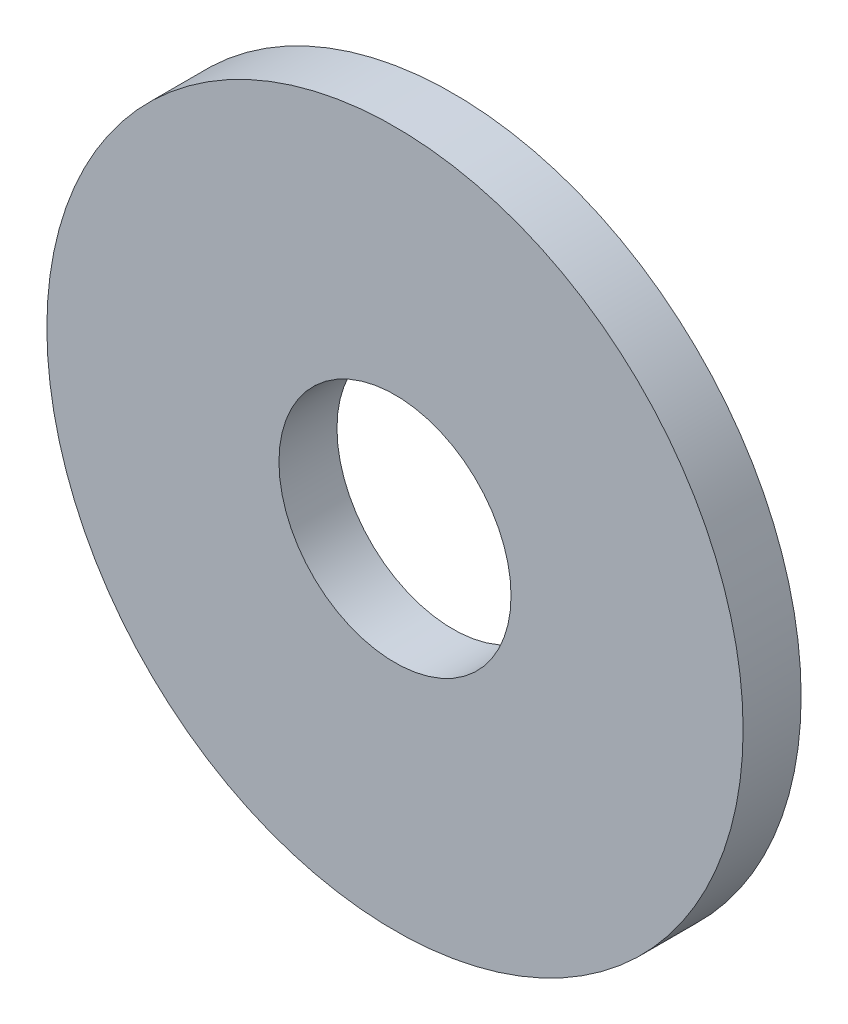
ISO-10303-21;
HEADER;
FILE_DESCRIPTION(('STEP AP214'),'2;1');
FILE_NAME('part.step','',(''),(''),'','','');
FILE_SCHEMA(('AUTOMOTIVE_DESIGN { 1 0 10303 214 1 1 1 1 }'));
ENDSEC;
DATA;
#1=APPLICATION_CONTEXT('core data for automotive mechanical design processes');
#2=APPLICATION_PROTOCOL_DEFINITION('international standard','automotive_design',2000,#1);
#3=PRODUCT_CONTEXT('',#1,'mechanical');
#4=PRODUCT('Part','Part','',(#3));
#5=PRODUCT_RELATED_PRODUCT_CATEGORY('part','',(#4));
#6=PRODUCT_DEFINITION_FORMATION('','',#4);
#7=PRODUCT_DEFINITION_CONTEXT('part definition',#1,'design');
#8=PRODUCT_DEFINITION('design','',#6,#7);
#9=PRODUCT_DEFINITION_SHAPE('','',#8);
#10=(LENGTH_UNIT() NAMED_UNIT(*) SI_UNIT(.MILLI.,.METRE.));
#11=(NAMED_UNIT(*) PLANE_ANGLE_UNIT() SI_UNIT($,.RADIAN.));
#12=(NAMED_UNIT(*) SI_UNIT($,.STERADIAN.) SOLID_ANGLE_UNIT());
#13=UNCERTAINTY_MEASURE_WITH_UNIT(LENGTH_MEASURE(1.E-05),#10,'distance_accuracy_value','');
#14=(GEOMETRIC_REPRESENTATION_CONTEXT(3) GLOBAL_UNCERTAINTY_ASSIGNED_CONTEXT((#13)) GLOBAL_UNIT_ASSIGNED_CONTEXT((#10,
#11,#12)) REPRESENTATION_CONTEXT('',''));
#15=CARTESIAN_POINT('',(0.,0.,0.));
#16=DIRECTION('',(0.,0.,1.));
#17=DIRECTION('',(1.,0.,0.));
#18=AXIS2_PLACEMENT_3D('',#15,#16,#17);
#19=CARTESIAN_POINT('',(0.,0.,-1.));
#20=DIRECTION('',(0.,0.,-1.));
#21=DIRECTION('',(1.,0.,0.));
#22=AXIS2_PLACEMENT_3D('',#19,#20,#21);
#23=PLANE('',#22);
#24=CARTESIAN_POINT('',(0.,0.,-1.));
#25=DIRECTION('',(0.,0.,1.));
#26=DIRECTION('',(1.,0.,0.));
#27=AXIS2_PLACEMENT_3D('',#24,#25,#26);
#28=CIRCLE('',#27,6.);
#29=CARTESIAN_POINT('',(6.,0.,-1.));
#30=VERTEX_POINT('',#29);
#31=EDGE_CURVE('E10',#30,#30,#28,.T.);
#32=ORIENTED_EDGE('',*,*,#31,.F.);
#33=EDGE_LOOP('',(#32));
#34=FACE_BOUND('',#33,.T.);
#35=CARTESIAN_POINT('',(0.,0.,-1.));
#36=DIRECTION('',(0.,0.,1.));
#37=DIRECTION('',(1.,0.,0.));
#38=AXIS2_PLACEMENT_3D('',#35,#36,#37);
#39=CIRCLE('',#38,2.);
#40=CARTESIAN_POINT('',(2.,0.,-1.));
#41=VERTEX_POINT('',#40);
#42=EDGE_CURVE('E46',#41,#41,#39,.T.);
#43=ORIENTED_EDGE('',*,*,#42,.T.);
#44=EDGE_LOOP('',(#43));
#45=FACE_BOUND('',#44,.T.);
#46=ADVANCED_FACE('F35',(#34,#45),#23,.T.);
#47=CARTESIAN_POINT('',(0.,0.,0.));
#48=DIRECTION('',(0.,0.,-1.));
#49=DIRECTION('',(1.,0.,0.));
#50=AXIS2_PLACEMENT_3D('',#47,#48,#49);
#51=PLANE('',#50);
#52=CARTESIAN_POINT('',(0.,0.,0.));
#53=DIRECTION('',(0.,0.,1.));
#54=DIRECTION('',(1.,0.,0.));
#55=AXIS2_PLACEMENT_3D('',#52,#53,#54);
#56=CIRCLE('',#55,6.);
#57=CARTESIAN_POINT('',(6.,0.,0.));
#58=VERTEX_POINT('',#57);
#59=EDGE_CURVE('E39',#58,#58,#56,.T.);
#60=ORIENTED_EDGE('',*,*,#59,.T.);
#61=EDGE_LOOP('',(#60));
#62=FACE_BOUND('',#61,.T.);
#63=CARTESIAN_POINT('',(0.,0.,0.));
#64=DIRECTION('',(0.,0.,1.));
#65=DIRECTION('',(1.,0.,0.));
#66=AXIS2_PLACEMENT_3D('',#63,#64,#65);
#67=CIRCLE('',#66,2.);
#68=CARTESIAN_POINT('',(2.,0.,0.));
#69=VERTEX_POINT('',#68);
#70=EDGE_CURVE('E48',#69,#69,#67,.T.);
#71=ORIENTED_EDGE('',*,*,#70,.F.);
#72=EDGE_LOOP('',(#71));
#73=FACE_BOUND('',#72,.T.);
#74=ADVANCED_FACE('F61',(#62,#73),#51,.F.);
#75=CARTESIAN_POINT('',(0.,0.,-1.));
#76=DIRECTION('',(0.,0.,1.));
#77=DIRECTION('',(-1.,0.,0.));
#78=AXIS2_PLACEMENT_3D('',#75,#76,#77);
#79=CYLINDRICAL_SURFACE('',#78,6.);
#80=ORIENTED_EDGE('',*,*,#31,.T.);
#81=EDGE_LOOP('',(#80));
#82=FACE_BOUND('',#81,.T.);
#83=ORIENTED_EDGE('',*,*,#59,.F.);
#84=EDGE_LOOP('',(#83));
#85=FACE_BOUND('',#84,.T.);
#86=ADVANCED_FACE('F37',(#82,#85),#79,.T.);
#87=CARTESIAN_POINT('',(0.,0.,-1.));
#88=DIRECTION('',(0.,0.,1.));
#89=DIRECTION('',(-1.,0.,0.));
#90=AXIS2_PLACEMENT_3D('',#87,#88,#89);
#91=CYLINDRICAL_SURFACE('',#90,2.);
#92=ORIENTED_EDGE('',*,*,#42,.F.);
#93=EDGE_LOOP('',(#92));
#94=FACE_BOUND('',#93,.T.);
#95=ORIENTED_EDGE('',*,*,#70,.T.);
#96=EDGE_LOOP('',(#95));
#97=FACE_BOUND('',#96,.T.);
#98=ADVANCED_FACE('F55',(#94,#97),#91,.F.);
#99=CLOSED_SHELL('',(#46,#74,#86,#98));
#100=MANIFOLD_SOLID_BREP('B2',#99);
#101=ADVANCED_BREP_SHAPE_REPRESENTATION('',(#18,#100),#14);
#102=SHAPE_DEFINITION_REPRESENTATION(#9,#101);
ENDSEC;
END-ISO-10303-21;
